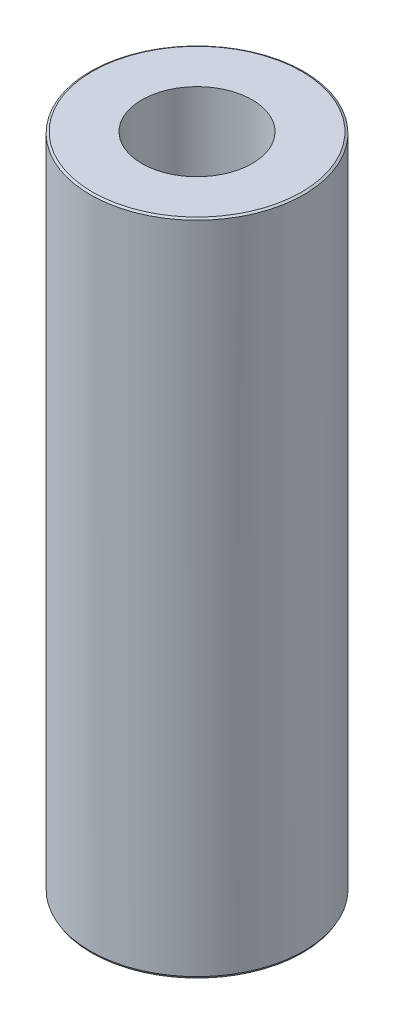
ISO-10303-21;
HEADER;
FILE_DESCRIPTION(('STEP AP214'),'2;1');
FILE_NAME('part.step','',(''),(''),'','','');
FILE_SCHEMA(('AUTOMOTIVE_DESIGN { 1 0 10303 214 1 1 1 1 }'));
ENDSEC;
DATA;
#1=APPLICATION_CONTEXT('core data for automotive mechanical design processes');
#2=APPLICATION_PROTOCOL_DEFINITION('international standard','automotive_design',2000,#1);
#3=PRODUCT_CONTEXT('',#1,'mechanical');
#4=PRODUCT('Part','Part','',(#3));
#5=PRODUCT_RELATED_PRODUCT_CATEGORY('part','',(#4));
#6=PRODUCT_DEFINITION_FORMATION('','',#4);
#7=PRODUCT_DEFINITION_CONTEXT('part definition',#1,'design');
#8=PRODUCT_DEFINITION('design','',#6,#7);
#9=PRODUCT_DEFINITION_SHAPE('','',#8);
#10=(LENGTH_UNIT() NAMED_UNIT(*) SI_UNIT(.MILLI.,.METRE.));
#11=(NAMED_UNIT(*) PLANE_ANGLE_UNIT() SI_UNIT($,.RADIAN.));
#12=(NAMED_UNIT(*) SI_UNIT($,.STERADIAN.) SOLID_ANGLE_UNIT());
#13=UNCERTAINTY_MEASURE_WITH_UNIT(LENGTH_MEASURE(1.E-05),#10,'distance_accuracy_value','');
#14=(GEOMETRIC_REPRESENTATION_CONTEXT(3) GLOBAL_UNCERTAINTY_ASSIGNED_CONTEXT((#13)) GLOBAL_UNIT_ASSIGNED_CONTEXT((#10,
#11,#12)) REPRESENTATION_CONTEXT('',''));
#15=CARTESIAN_POINT('',(0.,0.,0.));
#16=DIRECTION('',(0.,0.,1.));
#17=DIRECTION('',(1.,0.,0.));
#18=AXIS2_PLACEMENT_3D('',#15,#16,#17);
#19=CARTESIAN_POINT('',(0.,123.356648217816,0.));
#20=DIRECTION('',(0.,-1.,0.));
#21=DIRECTION('',(0.,0.,-1.));
#22=AXIS2_PLACEMENT_3D('',#19,#20,#21);
#23=CYLINDRICAL_SURFACE('',#22,20.);
#24=CARTESIAN_POINT('',(0.,123.125518318459,0.));
#25=DIRECTION('',(0.,1.,0.));
#26=DIRECTION('',(0.,0.,1.));
#27=AXIS2_PLACEMENT_3D('',#24,#25,#26);
#28=CIRCLE('',#27,20.);
#29=CARTESIAN_POINT('',(0.,123.125518318459,-20.));
#30=VERTEX_POINT('',#29);
#31=EDGE_CURVE('E50',#30,#30,#28,.F.);
#32=ORIENTED_EDGE('',*,*,#31,.T.);
#33=EDGE_LOOP('',(#32));
#34=FACE_BOUND('',#33,.T.);
#35=CARTESIAN_POINT('',(0.,0.400328728834928,0.));
#36=DIRECTION('',(0.,1.,0.));
#37=DIRECTION('',(0.,0.,1.));
#38=AXIS2_PLACEMENT_3D('',#35,#36,#37);
#39=CIRCLE('',#38,20.);
#40=CARTESIAN_POINT('',(0.,0.400328728834928,20.));
#41=VERTEX_POINT('',#40);
#42=EDGE_CURVE('E51',#41,#41,#39,.T.);
#43=ORIENTED_EDGE('',*,*,#42,.T.);
#44=EDGE_LOOP('',(#43));
#45=FACE_BOUND('',#44,.T.);
#46=ADVANCED_FACE('F39',(#34,#45),#23,.T.);
#47=CARTESIAN_POINT('',(0.,123.356648217816,0.));
#48=DIRECTION('',(0.,1.,0.));
#49=DIRECTION('',(0.,0.,1.));
#50=AXIS2_PLACEMENT_3D('',#47,#48,#49);
#51=PLANE('',#50);
#52=CARTESIAN_POINT('',(0.,123.356648217816,0.));
#53=DIRECTION('',(0.,1.,0.));
#54=DIRECTION('',(0.,0.,1.));
#55=AXIS2_PLACEMENT_3D('',#52,#53,#54);
#56=CIRCLE('',#55,19.5996712711651);
#57=CARTESIAN_POINT('',(0.,123.356648217816,-19.5996712711651));
#58=VERTEX_POINT('',#57);
#59=EDGE_CURVE('E54',#58,#58,#56,.T.);
#60=ORIENTED_EDGE('',*,*,#59,.T.);
#61=EDGE_LOOP('',(#60));
#62=FACE_BOUND('',#61,.T.);
#63=CARTESIAN_POINT('',(0.,123.356648217816,0.));
#64=DIRECTION('',(0.,1.,0.));
#65=DIRECTION('',(0.,0.,1.));
#66=AXIS2_PLACEMENT_3D('',#63,#64,#65);
#67=CIRCLE('',#66,10.3449056353815);
#68=CARTESIAN_POINT('',(0.,123.356648217816,10.3449056353815));
#69=VERTEX_POINT('',#68);
#70=EDGE_CURVE('E58',#69,#69,#67,.T.);
#71=ORIENTED_EDGE('',*,*,#70,.F.);
#72=EDGE_LOOP('',(#71));
#73=FACE_BOUND('',#72,.T.);
#74=ADVANCED_FACE('F69',(#62,#73),#51,.T.);
#75=CARTESIAN_POINT('',(0.,0.,0.));
#76=DIRECTION('',(0.,1.,0.));
#77=DIRECTION('',(0.,0.,1.));
#78=AXIS2_PLACEMENT_3D('',#75,#76,#77);
#79=PLANE('',#78);
#80=CARTESIAN_POINT('',(0.,0.,0.));
#81=DIRECTION('',(0.,1.,0.));
#82=DIRECTION('',(0.,0.,1.));
#83=AXIS2_PLACEMENT_3D('',#80,#81,#82);
#84=CIRCLE('',#83,19.7688701006428);
#85=CARTESIAN_POINT('',(0.,0.,19.7688701006428));
#86=VERTEX_POINT('',#85);
#87=EDGE_CURVE('E10',#86,#86,#84,.F.);
#88=ORIENTED_EDGE('',*,*,#87,.T.);
#89=EDGE_LOOP('',(#88));
#90=FACE_BOUND('',#89,.T.);
#91=CARTESIAN_POINT('',(0.,0.,0.));
#92=DIRECTION('',(0.,1.,0.));
#93=DIRECTION('',(0.,0.,1.));
#94=AXIS2_PLACEMENT_3D('',#91,#92,#93);
#95=CIRCLE('',#94,10.3449056353815);
#96=CARTESIAN_POINT('',(0.,0.,10.3449056353815));
#97=VERTEX_POINT('',#96);
#98=EDGE_CURVE('E63',#97,#97,#95,.T.);
#99=ORIENTED_EDGE('',*,*,#98,.T.);
#100=EDGE_LOOP('',(#99));
#101=FACE_BOUND('',#100,.T.);
#102=ADVANCED_FACE('F75',(#90,#101),#79,.F.);
#103=CARTESIAN_POINT('',(0.,123.356648217816,0.));
#104=DIRECTION('',(0.,-1.,0.));
#105=DIRECTION('',(0.,0.,-1.));
#106=AXIS2_PLACEMENT_3D('',#103,#104,#105);
#107=CYLINDRICAL_SURFACE('',#106,10.3449056353815);
#108=ORIENTED_EDGE('',*,*,#70,.T.);
#109=EDGE_LOOP('',(#108));
#110=FACE_BOUND('',#109,.T.);
#111=ORIENTED_EDGE('',*,*,#98,.F.);
#112=EDGE_LOOP('',(#111));
#113=FACE_BOUND('',#112,.T.);
#114=ADVANCED_FACE('F70',(#110,#113),#107,.F.);
#115=CARTESIAN_POINT('',(0.,123.356648217816,0.));
#116=DIRECTION('',(0.,-1.,0.));
#117=DIRECTION('',(0.,0.,-1.));
#118=AXIS2_PLACEMENT_3D('',#115,#116,#117);
#119=CONICAL_SURFACE('',#118,19.5996712711651,1.04719755119658);
#120=CARTESIAN_POINT('',(0.,123.125518318459,-20.));
#121=CARTESIAN_POINT('',(0.,123.127925921577,-19.9958299090746));
#122=CARTESIAN_POINT('',(0.,123.130333524696,-19.9916598181493));
#123=CARTESIAN_POINT('',(0.,123.135148730932,-19.9833196362986));
#124=CARTESIAN_POINT('',(0.,123.137556334051,-19.9791495453732));
#125=CARTESIAN_POINT('',(0.,123.142371540287,-19.9708093635225));
#126=CARTESIAN_POINT('',(0.,123.144779143406,-19.9666392725971));
#127=CARTESIAN_POINT('',(0.,123.149594349642,-19.9582990907464));
#128=CARTESIAN_POINT('',(0.,123.152001952761,-19.954128999821));
#129=CARTESIAN_POINT('',(0.,123.156817158997,-19.9457888179703));
#130=CARTESIAN_POINT('',(0.,123.159224762115,-19.9416187270449));
#131=CARTESIAN_POINT('',(0.,123.164039968352,-19.9332785451942));
#132=CARTESIAN_POINT('',(0.,123.16644757147,-19.9291084542688));
#133=CARTESIAN_POINT('',(0.,123.171262777707,-19.9207682724181));
#134=CARTESIAN_POINT('',(0.,123.173670380825,-19.9165981814927));
#135=CARTESIAN_POINT('',(0.,123.178485587062,-19.908257999642));
#136=CARTESIAN_POINT('',(0.,123.18089319018,-19.9040879087167));
#137=CARTESIAN_POINT('',(0.,123.185708396417,-19.8957477268659));
#138=CARTESIAN_POINT('',(0.,123.188115999535,-19.8915776359406));
#139=CARTESIAN_POINT('',(0.,123.192931205772,-19.8832374540898));
#140=CARTESIAN_POINT('',(0.,123.19533880889,-19.8790673631645));
#141=CARTESIAN_POINT('',(0.,123.200154015127,-19.8707271813137));
#142=CARTESIAN_POINT('',(0.,123.202561618245,-19.8665570903884));
#143=CARTESIAN_POINT('',(0.,123.207376824481,-19.8582169085377));
#144=CARTESIAN_POINT('',(0.,123.2097844276,-19.8540468176123));
#145=CARTESIAN_POINT('',(0.,123.214599633836,-19.8457066357616));
#146=CARTESIAN_POINT('',(0.,123.217007236955,-19.8415365448362));
#147=CARTESIAN_POINT('',(0.,123.221822443191,-19.8331963629855));
#148=CARTESIAN_POINT('',(0.,123.22423004631,-19.8290262720601));
#149=CARTESIAN_POINT('',(0.,123.229045252546,-19.8206860902094));
#150=CARTESIAN_POINT('',(0.,123.231452855665,-19.816515999284));
#151=CARTESIAN_POINT('',(0.,123.236268061901,-19.8081758174333));
#152=CARTESIAN_POINT('',(0.,123.238675665019,-19.8040057265079));
#153=CARTESIAN_POINT('',(0.,123.243490871256,-19.7956655446572));
#154=CARTESIAN_POINT('',(0.,123.245898474374,-19.7914954537318));
#155=CARTESIAN_POINT('',(0.,123.250713680611,-19.7831552718811));
#156=CARTESIAN_POINT('',(0.,123.253121283729,-19.7789851809558));
#157=CARTESIAN_POINT('',(0.,123.257936489966,-19.770644999105));
#158=CARTESIAN_POINT('',(0.,123.260344093084,-19.7664749081797));
#159=CARTESIAN_POINT('',(0.,123.265159299321,-19.7581347263289));
#160=CARTESIAN_POINT('',(0.,123.267566902439,-19.7539646354036));
#161=CARTESIAN_POINT('',(0.,123.272382108676,-19.7456244535528));
#162=CARTESIAN_POINT('',(0.,123.274789711794,-19.7414543626275));
#163=CARTESIAN_POINT('',(0.,123.279604918031,-19.7331141807768));
#164=CARTESIAN_POINT('',(0.,123.282012521149,-19.7289440898514));
#165=CARTESIAN_POINT('',(0.,123.286827727386,-19.7206039080007));
#166=CARTESIAN_POINT('',(0.,123.289235330504,-19.7164338170753));
#167=CARTESIAN_POINT('',(0.,123.29405053674,-19.7080936352246));
#168=CARTESIAN_POINT('',(0.,123.296458139859,-19.7039235442992));
#169=CARTESIAN_POINT('',(0.,123.301273346095,-19.6955833624485));
#170=CARTESIAN_POINT('',(0.,123.303680949214,-19.6914132715231));
#171=CARTESIAN_POINT('',(0.,123.30849615545,-19.6830730896724));
#172=CARTESIAN_POINT('',(0.,123.310903758569,-19.678902998747));
#173=CARTESIAN_POINT('',(0.,123.315718964805,-19.6705628168963));
#174=CARTESIAN_POINT('',(0.,123.318126567923,-19.6663927259709));
#175=CARTESIAN_POINT('',(0.,123.32294177416,-19.6580525441202));
#176=CARTESIAN_POINT('',(0.,123.325349377278,-19.6538824531948));
#177=CARTESIAN_POINT('',(0.,123.330164583515,-19.6455422713441));
#178=CARTESIAN_POINT('',(0.,123.332572186633,-19.6413721804188));
#179=CARTESIAN_POINT('',(0.,123.33738739287,-19.633031998568));
#180=CARTESIAN_POINT('',(0.,123.339794995988,-19.6288619076427));
#181=CARTESIAN_POINT('',(0.,123.344610202225,-19.6205217257919));
#182=CARTESIAN_POINT('',(0.,123.347017805343,-19.6163516348666));
#183=CARTESIAN_POINT('',(0.,123.35183301158,-19.6080114530159));
#184=CARTESIAN_POINT('',(0.,123.354240614698,-19.6038413620905));
#185=CARTESIAN_POINT('',(0.,123.356648217816,-19.5996712711651));
#186=B_SPLINE_CURVE_WITH_KNOTS('',3,(#120,#121,#122,#123,#124,#125,#126,#127,#128,#129,#130,
#131,#132,#133,#134,#135,#136,#137,#138,#139,#140,#141,#142,#143,#144,#145,#146,#147,#148,#149,
#150,#151,#152,#153,#154,#155,#156,#157,#158,#159,#160,#161,#162,#163,#164,#165,#166,#167,#168,
#169,#170,#171,#172,#173,#174,#175,#176,#177,#178,#179,#180,#181,#182,#183,#184,#185),
.UNSPECIFIED.,.F.,.F.,(4,2,2,2,2,2,2,2,2,2,2,2,2,2,2,2,2,2,2,2,2,2,2,2,2,2,2,2,2,2,2,2,4),(0.,
0.0144456187098158,0.0288912374196416,0.0433368561294605,0.0577824748392863,0.0722280935491051,
0.0866737122589309,0.10111933096875,0.115564949678576,0.130010568388401,0.14445618709822,
0.158901805808046,0.173347424517865,0.187793043227691,0.202238661937509,0.216684280647335,
0.231129899357161,0.24557551806698,0.260021136776806,0.274466755486624,0.28891237419645,
0.303357992906269,0.317803611616095,0.332249230325914,0.34669484903574,0.361140467745565,
0.375586086455384,0.39003170516521,0.404477323875029,0.418922942584855,0.433368561294674,
0.447814180004499,0.462259798714325),.UNSPECIFIED.);
#187=EDGE_CURVE('BSEAM81',#30,#58,#186,.T.);
#188=ORIENTED_EDGE('',*,*,#31,.F.);
#189=ORIENTED_EDGE('',*,*,#59,.F.);
#190=ORIENTED_EDGE('',*,*,#187,.T.);
#191=ORIENTED_EDGE('',*,*,#187,.F.);
#192=EDGE_LOOP('',(#188,#190,#189,#191));
#193=FACE_BOUND('',#192,.T.);
#194=ADVANCED_FACE('F81',(#193),#119,.T.);
#195=CARTESIAN_POINT('',(0.,0.400328728834928,0.));
#196=DIRECTION('',(0.,1.,0.));
#197=DIRECTION('',(0.,0.,1.));
#198=AXIS2_PLACEMENT_3D('',#195,#196,#197);
#199=CONICAL_SURFACE('',#198,20.,0.523598775598298);
#200=ORIENTED_EDGE('',*,*,#87,.F.);
#201=EDGE_LOOP('',(#200));
#202=FACE_BOUND('',#201,.T.);
#203=ORIENTED_EDGE('',*,*,#42,.F.);
#204=EDGE_LOOP('',(#203));
#205=FACE_BOUND('',#204,.T.);
#206=ADVANCED_FACE('F45',(#202,#205),#199,.T.);
#207=CLOSED_SHELL('',(#46,#74,#102,#114,#194,#206));
#208=MANIFOLD_SOLID_BREP('B2',#207);
#209=ADVANCED_BREP_SHAPE_REPRESENTATION('',(#18,#208),#14);
#210=SHAPE_DEFINITION_REPRESENTATION(#9,#209);
ENDSEC;
END-ISO-10303-21;
